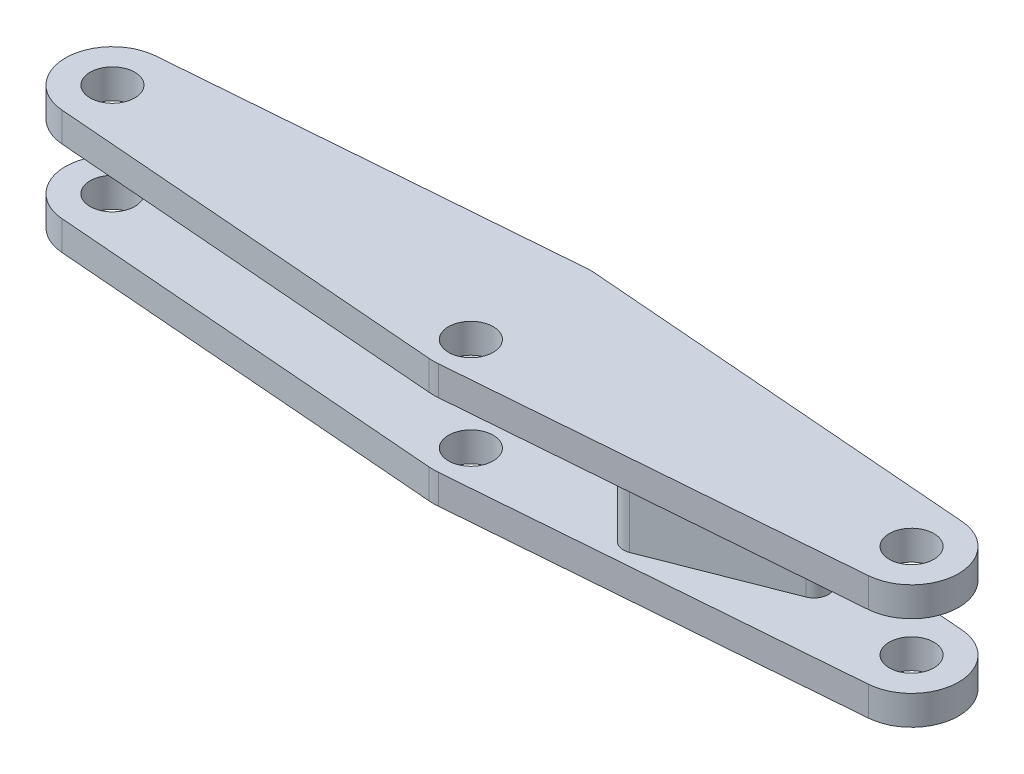
ISO-10303-21;
HEADER;
FILE_DESCRIPTION(('STEP AP214'),'2;1');
FILE_NAME('part.step','',(''),(''),'','','');
FILE_SCHEMA(('AUTOMOTIVE_DESIGN { 1 0 10303 214 1 1 1 1 }'));
ENDSEC;
DATA;
#1=APPLICATION_CONTEXT('core data for automotive mechanical design processes');
#2=APPLICATION_PROTOCOL_DEFINITION('international standard','automotive_design',2000,#1);
#3=PRODUCT_CONTEXT('',#1,'mechanical');
#4=PRODUCT('Part','Part','',(#3));
#5=PRODUCT_RELATED_PRODUCT_CATEGORY('part','',(#4));
#6=PRODUCT_DEFINITION_FORMATION('','',#4);
#7=PRODUCT_DEFINITION_CONTEXT('part definition',#1,'design');
#8=PRODUCT_DEFINITION('design','',#6,#7);
#9=PRODUCT_DEFINITION_SHAPE('','',#8);
#10=(LENGTH_UNIT() NAMED_UNIT(*) SI_UNIT(.MILLI.,.METRE.));
#11=(NAMED_UNIT(*) PLANE_ANGLE_UNIT() SI_UNIT($,.RADIAN.));
#12=(NAMED_UNIT(*) SI_UNIT($,.STERADIAN.) SOLID_ANGLE_UNIT());
#13=UNCERTAINTY_MEASURE_WITH_UNIT(LENGTH_MEASURE(1.E-05),#10,'distance_accuracy_value','');
#14=(GEOMETRIC_REPRESENTATION_CONTEXT(3) GLOBAL_UNCERTAINTY_ASSIGNED_CONTEXT((#13)) GLOBAL_UNIT_ASSIGNED_CONTEXT((#10,
#11,#12)) REPRESENTATION_CONTEXT('',''));
#15=CARTESIAN_POINT('',(0.,0.,0.));
#16=DIRECTION('',(0.,0.,1.));
#17=DIRECTION('',(1.,0.,0.));
#18=AXIS2_PLACEMENT_3D('',#15,#16,#17);
#19=CARTESIAN_POINT('',(-85.,13.125,0.));
#20=DIRECTION('',(0.,-1.,0.));
#21=DIRECTION('',(0.,0.,-1.));
#22=AXIS2_PLACEMENT_3D('',#19,#20,#21);
#23=CYLINDRICAL_SURFACE('',#22,9.99999999999999);
#24=CARTESIAN_POINT('',(-85.,6.875,0.));
#25=DIRECTION('',(0.,1.,0.));
#26=DIRECTION('',(0.,0.,1.));
#27=AXIS2_PLACEMENT_3D('',#24,#25,#26);
#28=CIRCLE('',#27,9.99999999999999);
#29=CARTESIAN_POINT('',(-85.7879901486688,6.875,-9.96890523205035));
#30=VERTEX_POINT('',#29);
#31=CARTESIAN_POINT('',(-85.7879901486688,6.875,9.96890523205035));
#32=VERTEX_POINT('',#31);
#33=EDGE_CURVE('E84',#30,#32,#28,.T.);
#34=ORIENTED_EDGE('',*,*,#33,.T.);
#35=DIRECTION('',(0.,-1.,0.));
#36=VECTOR('',#35,1.);
#37=CARTESIAN_POINT('',(-85.7879901486688,13.125,9.96890523205035));
#38=LINE('',#37,#36);
#39=CARTESIAN_POINT('',(-85.7879901486688,13.125,9.96890523205035));
#40=VERTEX_POINT('',#39);
#41=EDGE_CURVE('E301',#40,#32,#38,.T.);
#42=ORIENTED_EDGE('',*,*,#41,.F.);
#43=CARTESIAN_POINT('',(-85.,13.125,0.));
#44=DIRECTION('',(0.,1.,0.));
#45=DIRECTION('',(0.,0.,1.));
#46=AXIS2_PLACEMENT_3D('',#43,#44,#45);
#47=CIRCLE('',#46,9.99999999999999);
#48=CARTESIAN_POINT('',(-85.7879901486688,13.125,-9.96890523205035));
#49=VERTEX_POINT('',#48);
#50=EDGE_CURVE('E280',#49,#40,#47,.T.);
#51=ORIENTED_EDGE('',*,*,#50,.F.);
#52=DIRECTION('',(0.,-1.,0.));
#53=VECTOR('',#52,1.);
#54=CARTESIAN_POINT('',(-85.7879901486688,13.125,-9.96890523205035));
#55=LINE('',#54,#53);
#56=EDGE_CURVE('E37',#49,#30,#55,.T.);
#57=ORIENTED_EDGE('',*,*,#56,.T.);
#58=EDGE_LOOP('',(#34,#42,#51,#57));
#59=FACE_BOUND('',#58,.T.);
#60=ADVANCED_FACE('F33',(#59),#23,.T.);
#61=CARTESIAN_POINT('',(-0.984987685835979,13.125,16.6721418425663));
#62=DIRECTION('',(0.0787990148668748,0.,-0.996890523205036));
#63=DIRECTION('',(-0.996890523205036,0.,-0.0787990148668748));
#64=AXIS2_PLACEMENT_3D('',#61,#62,#63);
#65=PLANE('',#64);
#66=ORIENTED_EDGE('',*,*,#41,.T.);
#67=DIRECTION('',(0.996890523205036,0.,0.0787990148668748));
#68=VECTOR('',#67,1.);
#69=CARTESIAN_POINT('',(-0.984987685835979,6.875,16.6721418425663));
#70=LINE('',#69,#68);
#71=CARTESIAN_POINT('',(-0.984987685835975,6.875,16.6721418425663));
#72=VERTEX_POINT('',#71);
#73=EDGE_CURVE('E299',#32,#72,#70,.T.);
#74=ORIENTED_EDGE('',*,*,#73,.T.);
#75=DIRECTION('',(0.,-1.,0.));
#76=VECTOR('',#75,1.);
#77=CARTESIAN_POINT('',(-0.984987685835975,13.125,16.6721418425663));
#78=LINE('',#77,#76);
#79=CARTESIAN_POINT('',(-0.984987685835975,13.125,16.6721418425663));
#80=VERTEX_POINT('',#79);
#81=EDGE_CURVE('E294',#80,#72,#78,.T.);
#82=ORIENTED_EDGE('',*,*,#81,.F.);
#83=DIRECTION('',(0.996890523205036,0.,0.0787990148668748));
#84=VECTOR('',#83,1.);
#85=CARTESIAN_POINT('',(-0.984987685835979,13.125,16.6721418425663));
#86=LINE('',#85,#84);
#87=EDGE_CURVE('E115',#40,#80,#86,.T.);
#88=ORIENTED_EDGE('',*,*,#87,.F.);
#89=EDGE_LOOP('',(#66,#74,#82,#88));
#90=FACE_BOUND('',#89,.T.);
#91=ADVANCED_FACE('F364',(#90),#65,.F.);
#92=CARTESIAN_POINT('',(0.,13.125,4.21101030250334));
#93=DIRECTION('',(0.,-1.,0.));
#94=DIRECTION('',(0.,0.,-1.));
#95=AXIS2_PLACEMENT_3D('',#92,#93,#94);
#96=CYLINDRICAL_SURFACE('',#95,12.5);
#97=ORIENTED_EDGE('',*,*,#81,.T.);
#98=CARTESIAN_POINT('',(0.,6.875,4.21101030250334));
#99=DIRECTION('',(0.,1.,0.));
#100=DIRECTION('',(0.,0.,1.));
#101=AXIS2_PLACEMENT_3D('',#98,#99,#100);
#102=CIRCLE('',#101,12.5);
#103=CARTESIAN_POINT('',(0.984987685835979,6.875,16.6721418425663));
#104=VERTEX_POINT('',#103);
#105=EDGE_CURVE('E59',#72,#104,#102,.T.);
#106=ORIENTED_EDGE('',*,*,#105,.T.);
#107=DIRECTION('',(0.,-1.,0.));
#108=VECTOR('',#107,1.);
#109=CARTESIAN_POINT('',(0.984987685835979,13.125,16.6721418425663));
#110=LINE('',#109,#108);
#111=CARTESIAN_POINT('',(0.984987685835979,13.125,16.6721418425663));
#112=VERTEX_POINT('',#111);
#113=EDGE_CURVE('E293',#112,#104,#110,.T.);
#114=ORIENTED_EDGE('',*,*,#113,.F.);
#115=CARTESIAN_POINT('',(0.,13.125,4.21101030250334));
#116=DIRECTION('',(0.,1.,0.));
#117=DIRECTION('',(0.,0.,-1.));
#118=AXIS2_PLACEMENT_3D('',#115,#116,#117);
#119=CIRCLE('',#118,12.5);
#120=EDGE_CURVE('E277',#80,#112,#119,.T.);
#121=ORIENTED_EDGE('',*,*,#120,.F.);
#122=EDGE_LOOP('',(#97,#106,#114,#121));
#123=FACE_BOUND('',#122,.T.);
#124=ADVANCED_FACE('F361',(#123),#96,.T.);
#125=CARTESIAN_POINT('',(0.984987685835979,13.125,16.6721418425663));
#126=DIRECTION('',(-0.0787990148668748,0.,-0.996890523205036));
#127=DIRECTION('',(-0.996890523205036,0.,0.0787990148668748));
#128=AXIS2_PLACEMENT_3D('',#125,#126,#127);
#129=PLANE('',#128);
#130=ORIENTED_EDGE('',*,*,#113,.T.);
#131=DIRECTION('',(0.996890523205036,0.,-0.0787990148668748));
#132=VECTOR('',#131,1.);
#133=CARTESIAN_POINT('',(0.984987685835979,6.875,16.6721418425663));
#134=LINE('',#133,#132);
#135=CARTESIAN_POINT('',(85.7879901486688,6.875,9.96890523205035));
#136=VERTEX_POINT('',#135);
#137=EDGE_CURVE('E295',#104,#136,#134,.T.);
#138=ORIENTED_EDGE('',*,*,#137,.T.);
#139=DIRECTION('',(0.,-1.,0.));
#140=VECTOR('',#139,1.);
#141=CARTESIAN_POINT('',(85.7879901486688,13.125,9.96890523205035));
#142=LINE('',#141,#140);
#143=CARTESIAN_POINT('',(85.7879901486688,13.125,9.96890523205035));
#144=VERTEX_POINT('',#143);
#145=EDGE_CURVE('E303',#144,#136,#142,.T.);
#146=ORIENTED_EDGE('',*,*,#145,.F.);
#147=DIRECTION('',(0.996890523205036,0.,-0.0787990148668748));
#148=VECTOR('',#147,1.);
#149=CARTESIAN_POINT('',(0.984987685835979,13.125,16.6721418425663));
#150=LINE('',#149,#148);
#151=EDGE_CURVE('E275',#112,#144,#150,.T.);
#152=ORIENTED_EDGE('',*,*,#151,.F.);
#153=EDGE_LOOP('',(#130,#138,#146,#152));
#154=FACE_BOUND('',#153,.T.);
#155=ADVANCED_FACE('F350',(#154),#129,.F.);
#156=CARTESIAN_POINT('',(85.,13.125,0.));
#157=DIRECTION('',(0.,-1.,0.));
#158=DIRECTION('',(0.,0.,-1.));
#159=AXIS2_PLACEMENT_3D('',#156,#157,#158);
#160=CYLINDRICAL_SURFACE('',#159,9.99999999999999);
#161=CARTESIAN_POINT('',(85.,6.875,0.));
#162=DIRECTION('',(0.,1.,0.));
#163=DIRECTION('',(0.,0.,1.));
#164=AXIS2_PLACEMENT_3D('',#161,#162,#163);
#165=CIRCLE('',#164,9.99999999999999);
#166=CARTESIAN_POINT('',(85.7879901486688,6.875,-9.96890523205035));
#167=VERTEX_POINT('',#166);
#168=EDGE_CURVE('E298',#136,#167,#165,.T.);
#169=ORIENTED_EDGE('',*,*,#168,.T.);
#170=DIRECTION('',(0.,-1.,0.));
#171=VECTOR('',#170,1.);
#172=CARTESIAN_POINT('',(85.7879901486688,13.125,-9.96890523205035));
#173=LINE('',#172,#171);
#174=CARTESIAN_POINT('',(85.7879901486688,13.125,-9.96890523205035));
#175=VERTEX_POINT('',#174);
#176=EDGE_CURVE('E308',#175,#167,#173,.T.);
#177=ORIENTED_EDGE('',*,*,#176,.F.);
#178=CARTESIAN_POINT('',(85.,13.125,0.));
#179=DIRECTION('',(0.,1.,0.));
#180=DIRECTION('',(0.,0.,-1.));
#181=AXIS2_PLACEMENT_3D('',#178,#179,#180);
#182=CIRCLE('',#181,9.99999999999999);
#183=EDGE_CURVE('E273',#144,#175,#182,.T.);
#184=ORIENTED_EDGE('',*,*,#183,.F.);
#185=ORIENTED_EDGE('',*,*,#145,.T.);
#186=EDGE_LOOP('',(#169,#177,#184,#185));
#187=FACE_BOUND('',#186,.T.);
#188=ADVANCED_FACE('F353',(#187),#160,.T.);
#189=CARTESIAN_POINT('',(0.984987685835979,13.125,-16.6721418425663));
#190=DIRECTION('',(-0.0787990148668748,0.,0.996890523205036));
#191=DIRECTION('',(0.996890523205036,0.,0.0787990148668748));
#192=AXIS2_PLACEMENT_3D('',#189,#190,#191);
#193=PLANE('',#192);
#194=ORIENTED_EDGE('',*,*,#176,.T.);
#195=DIRECTION('',(-0.996890523205036,0.,-0.0787990148668748));
#196=VECTOR('',#195,1.);
#197=CARTESIAN_POINT('',(0.984987685835979,6.875,-16.6721418425663));
#198=LINE('',#197,#196);
#199=CARTESIAN_POINT('',(0.984987685835982,6.875,-16.6721418425663));
#200=VERTEX_POINT('',#199);
#201=EDGE_CURVE('E304',#167,#200,#198,.T.);
#202=ORIENTED_EDGE('',*,*,#201,.T.);
#203=DIRECTION('',(0.,-1.,0.));
#204=VECTOR('',#203,1.);
#205=CARTESIAN_POINT('',(0.984987685835982,13.125,-16.6721418425663));
#206=LINE('',#205,#204);
#207=CARTESIAN_POINT('',(0.984987685835982,13.125,-16.6721418425663));
#208=VERTEX_POINT('',#207);
#209=EDGE_CURVE('E311',#208,#200,#206,.T.);
#210=ORIENTED_EDGE('',*,*,#209,.F.);
#211=DIRECTION('',(-0.996890523205036,0.,-0.0787990148668748));
#212=VECTOR('',#211,1.);
#213=CARTESIAN_POINT('',(0.984987685835979,13.125,-16.6721418425663));
#214=LINE('',#213,#212);
#215=EDGE_CURVE('E271',#175,#208,#214,.T.);
#216=ORIENTED_EDGE('',*,*,#215,.F.);
#217=EDGE_LOOP('',(#194,#202,#210,#216));
#218=FACE_BOUND('',#217,.T.);
#219=ADVANCED_FACE('F343',(#218),#193,.F.);
#220=CARTESIAN_POINT('',(-0.984987685835979,13.125,-16.6721418425663));
#221=DIRECTION('',(0.0787990148668748,0.,0.996890523205036));
#222=DIRECTION('',(0.996890523205036,0.,-0.0787990148668748));
#223=AXIS2_PLACEMENT_3D('',#220,#221,#222);
#224=PLANE('',#223);
#225=DIRECTION('',(0.,-1.,0.));
#226=VECTOR('',#225,1.);
#227=CARTESIAN_POINT('',(-0.984987685835979,13.125,-16.6721418425663));
#228=LINE('',#227,#226);
#229=CARTESIAN_POINT('',(-0.984987685835979,13.125,-16.6721418425663));
#230=VERTEX_POINT('',#229);
#231=CARTESIAN_POINT('',(-0.984987685835979,6.875,-16.6721418425663));
#232=VERTEX_POINT('',#231);
#233=EDGE_CURVE('E307',#230,#232,#228,.T.);
#234=ORIENTED_EDGE('',*,*,#233,.T.);
#235=DIRECTION('',(-0.996890523205036,0.,0.0787990148668748));
#236=VECTOR('',#235,1.);
#237=CARTESIAN_POINT('',(-0.984987685835979,6.875,-16.6721418425663));
#238=LINE('',#237,#236);
#239=EDGE_CURVE('E287',#232,#30,#238,.T.);
#240=ORIENTED_EDGE('',*,*,#239,.T.);
#241=ORIENTED_EDGE('',*,*,#56,.F.);
#242=DIRECTION('',(-0.996890523205036,0.,0.0787990148668748));
#243=VECTOR('',#242,1.);
#244=CARTESIAN_POINT('',(-0.984987685835979,13.125,-16.6721418425663));
#245=LINE('',#244,#243);
#246=EDGE_CURVE('E267',#230,#49,#245,.T.);
#247=ORIENTED_EDGE('',*,*,#246,.F.);
#248=EDGE_LOOP('',(#234,#240,#241,#247));
#249=FACE_BOUND('',#248,.T.);
#250=ADVANCED_FACE('F330',(#249),#224,.F.);
#251=CARTESIAN_POINT('',(-85.,13.125,0.));
#252=DIRECTION('',(0.,-1.,0.));
#253=DIRECTION('',(0.,0.,-1.));
#254=AXIS2_PLACEMENT_3D('',#251,#252,#253);
#255=CYLINDRICAL_SURFACE('',#254,4.75);
#256=CARTESIAN_POINT('',(-85.,6.875,0.));
#257=DIRECTION('',(0.,1.,0.));
#258=DIRECTION('',(0.,0.,1.));
#259=AXIS2_PLACEMENT_3D('',#256,#257,#258);
#260=CIRCLE('',#259,4.75);
#261=CARTESIAN_POINT('',(-85.,6.875,4.75));
#262=VERTEX_POINT('',#261);
#263=EDGE_CURVE('E313',#262,#262,#260,.T.);
#264=ORIENTED_EDGE('',*,*,#263,.F.);
#265=EDGE_LOOP('',(#264));
#266=FACE_BOUND('',#265,.T.);
#267=CARTESIAN_POINT('',(-85.,13.125,0.));
#268=DIRECTION('',(0.,1.,0.));
#269=DIRECTION('',(0.,0.,1.));
#270=AXIS2_PLACEMENT_3D('',#267,#268,#269);
#271=CIRCLE('',#270,4.75);
#272=CARTESIAN_POINT('',(-85.,13.125,4.75));
#273=VERTEX_POINT('',#272);
#274=EDGE_CURVE('E283',#273,#273,#271,.T.);
#275=ORIENTED_EDGE('',*,*,#274,.T.);
#276=EDGE_LOOP('',(#275));
#277=FACE_BOUND('',#276,.T.);
#278=ADVANCED_FACE('F403',(#266,#277),#255,.F.);
#279=CARTESIAN_POINT('',(85.,13.125,0.));
#280=DIRECTION('',(0.,-1.,0.));
#281=DIRECTION('',(0.,0.,-1.));
#282=AXIS2_PLACEMENT_3D('',#279,#280,#281);
#283=CYLINDRICAL_SURFACE('',#282,4.75);
#284=CARTESIAN_POINT('',(85.,6.875,0.));
#285=DIRECTION('',(0.,1.,0.));
#286=DIRECTION('',(0.,0.,1.));
#287=AXIS2_PLACEMENT_3D('',#284,#285,#286);
#288=CIRCLE('',#287,4.75);
#289=CARTESIAN_POINT('',(85.,6.875,4.75));
#290=VERTEX_POINT('',#289);
#291=EDGE_CURVE('E42',#290,#290,#288,.T.);
#292=ORIENTED_EDGE('',*,*,#291,.F.);
#293=EDGE_LOOP('',(#292));
#294=FACE_BOUND('',#293,.T.);
#295=CARTESIAN_POINT('',(85.,13.125,0.));
#296=DIRECTION('',(0.,1.,0.));
#297=DIRECTION('',(0.,0.,-1.));
#298=AXIS2_PLACEMENT_3D('',#295,#296,#297);
#299=CIRCLE('',#298,4.75);
#300=CARTESIAN_POINT('',(85.,13.125,-4.75));
#301=VERTEX_POINT('',#300);
#302=EDGE_CURVE('E286',#301,#301,#299,.T.);
#303=ORIENTED_EDGE('',*,*,#302,.T.);
#304=EDGE_LOOP('',(#303));
#305=FACE_BOUND('',#304,.T.);
#306=ADVANCED_FACE('F412',(#294,#305),#283,.F.);
#307=CARTESIAN_POINT('',(0.,13.125,8.75));
#308=DIRECTION('',(0.,-1.,0.));
#309=DIRECTION('',(0.,0.,-1.));
#310=AXIS2_PLACEMENT_3D('',#307,#308,#309);
#311=CYLINDRICAL_SURFACE('',#310,4.75);
#312=CARTESIAN_POINT('',(0.,6.875,8.75));
#313=DIRECTION('',(0.,1.,0.));
#314=DIRECTION('',(0.,0.,1.));
#315=AXIS2_PLACEMENT_3D('',#312,#313,#314);
#316=CIRCLE('',#315,4.75);
#317=CARTESIAN_POINT('',(0.,6.875,13.5));
#318=VERTEX_POINT('',#317);
#319=EDGE_CURVE('E11',#318,#318,#316,.T.);
#320=ORIENTED_EDGE('',*,*,#319,.F.);
#321=EDGE_LOOP('',(#320));
#322=FACE_BOUND('',#321,.T.);
#323=CARTESIAN_POINT('',(0.,13.125,8.75));
#324=DIRECTION('',(0.,1.,0.));
#325=DIRECTION('',(0.,0.,1.));
#326=AXIS2_PLACEMENT_3D('',#323,#324,#325);
#327=CIRCLE('',#326,4.75);
#328=CARTESIAN_POINT('',(0.,13.125,13.5));
#329=VERTEX_POINT('',#328);
#330=EDGE_CURVE('E282',#329,#329,#327,.T.);
#331=ORIENTED_EDGE('',*,*,#330,.T.);
#332=EDGE_LOOP('',(#331));
#333=FACE_BOUND('',#332,.T.);
#334=ADVANCED_FACE('F35',(#322,#333),#311,.F.);
#335=CARTESIAN_POINT('',(-85.,13.125,0.));
#336=DIRECTION('',(0.,1.,0.));
#337=DIRECTION('',(0.,0.,1.));
#338=AXIS2_PLACEMENT_3D('',#335,#336,#337);
#339=PLANE('',#338);
#340=ORIENTED_EDGE('',*,*,#302,.F.);
#341=EDGE_LOOP('',(#340));
#342=FACE_BOUND('',#341,.T.);
#343=ORIENTED_EDGE('',*,*,#50,.T.);
#344=ORIENTED_EDGE('',*,*,#87,.T.);
#345=ORIENTED_EDGE('',*,*,#120,.T.);
#346=ORIENTED_EDGE('',*,*,#151,.T.);
#347=ORIENTED_EDGE('',*,*,#183,.T.);
#348=ORIENTED_EDGE('',*,*,#215,.T.);
#349=CARTESIAN_POINT('',(0.,13.125,-4.21101030250334));
#350=DIRECTION('',(0.,1.,0.));
#351=DIRECTION('',(0.,0.,-1.));
#352=AXIS2_PLACEMENT_3D('',#349,#350,#351);
#353=CIRCLE('',#352,12.5);
#354=EDGE_CURVE('E269',#208,#230,#353,.T.);
#355=ORIENTED_EDGE('',*,*,#354,.T.);
#356=ORIENTED_EDGE('',*,*,#246,.T.);
#357=EDGE_LOOP('',(#343,#344,#345,#346,#347,#348,#355,#356));
#358=FACE_BOUND('',#357,.T.);
#359=ORIENTED_EDGE('',*,*,#274,.F.);
#360=EDGE_LOOP('',(#359));
#361=FACE_BOUND('',#360,.T.);
#362=ORIENTED_EDGE('',*,*,#330,.F.);
#363=EDGE_LOOP('',(#362));
#364=FACE_BOUND('',#363,.T.);
#365=ADVANCED_FACE('F337',(#342,#358,#361,#364),#339,.T.);
#366=CARTESIAN_POINT('',(0.,13.125,-4.21101030250334));
#367=DIRECTION('',(0.,-1.,0.));
#368=DIRECTION('',(0.,0.,-1.));
#369=AXIS2_PLACEMENT_3D('',#366,#367,#368);
#370=CYLINDRICAL_SURFACE('',#369,12.5);
#371=CARTESIAN_POINT('',(0.,6.875,-4.21101030250334));
#372=DIRECTION('',(0.,1.,0.));
#373=DIRECTION('',(0.,0.,1.));
#374=AXIS2_PLACEMENT_3D('',#371,#372,#373);
#375=CIRCLE('',#374,12.5);
#376=EDGE_CURVE('E80',#200,#232,#375,.T.);
#377=ORIENTED_EDGE('',*,*,#376,.T.);
#378=ORIENTED_EDGE('',*,*,#233,.F.);
#379=ORIENTED_EDGE('',*,*,#354,.F.);
#380=ORIENTED_EDGE('',*,*,#209,.T.);
#381=EDGE_LOOP('',(#377,#378,#379,#380));
#382=FACE_BOUND('',#381,.T.);
#383=ADVANCED_FACE('F334',(#382),#370,.T.);
#384=CARTESIAN_POINT('',(95.,6.875,-16.7110103025033));
#385=DIRECTION('',(0.,1.,0.));
#386=DIRECTION('',(0.,0.,1.));
#387=AXIS2_PLACEMENT_3D('',#384,#385,#386);
#388=PLANE('',#387);
#389=DIRECTION('',(-0.93128348730271,0.,0.364295300926738));
#390=VECTOR('',#389,1.);
#391=CARTESIAN_POINT('',(33.9071140972198,6.875,5.52071326496727));
#392=LINE('',#391,#390);
#393=CARTESIAN_POINT('',(60.9143352289984,6.875,-5.04385046190813));
#394=VERTEX_POINT('',#393);
#395=CARTESIAN_POINT('',(33.9071140972198,6.875,5.52071326496727));
#396=VERTEX_POINT('',#395);
#397=EDGE_CURVE('E248',#394,#396,#392,.T.);
#398=ORIENTED_EDGE('',*,*,#397,.T.);
#399=CARTESIAN_POINT('',(35.,6.875,8.3145637268754));
#400=DIRECTION('',(0.,1.,0.));
#401=DIRECTION('',(0.,0.,1.));
#402=AXIS2_PLACEMENT_3D('',#399,#400,#401);
#403=CIRCLE('',#402,3.);
#404=CARTESIAN_POINT('',(36.0928859027802,6.875,11.1084141887835));
#405=VERTEX_POINT('',#404);
#406=EDGE_CURVE('E237',#396,#405,#403,.T.);
#407=ORIENTED_EDGE('',*,*,#406,.T.);
#408=DIRECTION('',(0.93128348730271,0.,-0.364295300926738));
#409=VECTOR('',#408,1.);
#410=CARTESIAN_POINT('',(36.0928859027802,6.875,11.1084141887835));
#411=LINE('',#410,#409);
#412=CARTESIAN_POINT('',(63.1001070345588,6.875,0.54385046190813));
#413=VERTEX_POINT('',#412);
#414=EDGE_CURVE('E244',#405,#413,#411,.T.);
#415=ORIENTED_EDGE('',*,*,#414,.T.);
#416=CARTESIAN_POINT('',(62.0072211317786,6.875,-2.25));
#417=DIRECTION('',(0.,1.,0.));
#418=DIRECTION('',(0.,0.,1.));
#419=AXIS2_PLACEMENT_3D('',#416,#417,#418);
#420=CIRCLE('',#419,3.);
#421=EDGE_CURVE('E50',#413,#394,#420,.T.);
#422=ORIENTED_EDGE('',*,*,#421,.T.);
#423=EDGE_LOOP('',(#398,#407,#415,#422));
#424=FACE_BOUND('',#423,.T.);
#425=ORIENTED_EDGE('',*,*,#263,.T.);
#426=EDGE_LOOP('',(#425));
#427=FACE_BOUND('',#426,.T.);
#428=ORIENTED_EDGE('',*,*,#291,.T.);
#429=EDGE_LOOP('',(#428));
#430=FACE_BOUND('',#429,.T.);
#431=ORIENTED_EDGE('',*,*,#319,.T.);
#432=EDGE_LOOP('',(#431));
#433=FACE_BOUND('',#432,.T.);
#434=ORIENTED_EDGE('',*,*,#73,.F.);
#435=ORIENTED_EDGE('',*,*,#33,.F.);
#436=ORIENTED_EDGE('',*,*,#239,.F.);
#437=ORIENTED_EDGE('',*,*,#376,.F.);
#438=ORIENTED_EDGE('',*,*,#201,.F.);
#439=ORIENTED_EDGE('',*,*,#168,.F.);
#440=ORIENTED_EDGE('',*,*,#137,.F.);
#441=ORIENTED_EDGE('',*,*,#105,.F.);
#442=EDGE_LOOP('',(#434,#435,#436,#437,#438,#439,#440,#441));
#443=FACE_BOUND('',#442,.T.);
#444=ADVANCED_FACE('F346',(#424,#427,#430,#433,#443),#388,.F.);
#445=CARTESIAN_POINT('',(35.,-6.875,8.3145637268754));
#446=DIRECTION('',(0.,1.,0.));
#447=DIRECTION('',(0.,0.,1.));
#448=AXIS2_PLACEMENT_3D('',#445,#446,#447);
#449=CYLINDRICAL_SURFACE('',#448,3.);
#450=DIRECTION('',(0.,1.,0.));
#451=VECTOR('',#450,1.);
#452=CARTESIAN_POINT('',(36.0928859027802,-6.875,11.1084141887835));
#453=LINE('',#452,#451);
#454=CARTESIAN_POINT('',(36.0928859027802,-6.875,11.1084141887835));
#455=VERTEX_POINT('',#454);
#456=EDGE_CURVE('E260',#455,#405,#453,.T.);
#457=ORIENTED_EDGE('',*,*,#456,.T.);
#458=ORIENTED_EDGE('',*,*,#406,.F.);
#459=DIRECTION('',(0.,1.,0.));
#460=VECTOR('',#459,1.);
#461=CARTESIAN_POINT('',(33.9071140972198,-6.875,5.52071326496727));
#462=LINE('',#461,#460);
#463=CARTESIAN_POINT('',(33.9071140972198,-6.875,5.52071326496727));
#464=VERTEX_POINT('',#463);
#465=EDGE_CURVE('E130',#464,#396,#462,.T.);
#466=ORIENTED_EDGE('',*,*,#465,.F.);
#467=CARTESIAN_POINT('',(35.,-6.875,8.3145637268754));
#468=DIRECTION('',(0.,1.,0.));
#469=DIRECTION('',(0.,0.,1.));
#470=AXIS2_PLACEMENT_3D('',#467,#468,#469);
#471=CIRCLE('',#470,3.);
#472=EDGE_CURVE('E251',#464,#455,#471,.T.);
#473=ORIENTED_EDGE('',*,*,#472,.T.);
#474=EDGE_LOOP('',(#457,#458,#466,#473));
#475=FACE_BOUND('',#474,.T.);
#476=ADVANCED_FACE('F456',(#475),#449,.T.);
#477=CARTESIAN_POINT('',(33.9071140972198,-6.875,5.52071326496727));
#478=DIRECTION('',(-0.364295300926738,0.,-0.93128348730271));
#479=DIRECTION('',(-0.93128348730271,0.,0.364295300926738));
#480=AXIS2_PLACEMENT_3D('',#477,#478,#479);
#481=PLANE('',#480);
#482=ORIENTED_EDGE('',*,*,#465,.T.);
#483=ORIENTED_EDGE('',*,*,#397,.F.);
#484=DIRECTION('',(0.,1.,0.));
#485=VECTOR('',#484,1.);
#486=CARTESIAN_POINT('',(60.9143352289984,-6.875,-5.04385046190813));
#487=LINE('',#486,#485);
#488=CARTESIAN_POINT('',(60.9143352289984,-6.875,-5.04385046190813));
#489=VERTEX_POINT('',#488);
#490=EDGE_CURVE('E262',#489,#394,#487,.T.);
#491=ORIENTED_EDGE('',*,*,#490,.F.);
#492=DIRECTION('',(-0.93128348730271,0.,0.364295300926738));
#493=VECTOR('',#492,1.);
#494=CARTESIAN_POINT('',(33.9071140972198,-6.875,5.52071326496727));
#495=LINE('',#494,#493);
#496=EDGE_CURVE('E258',#489,#464,#495,.T.);
#497=ORIENTED_EDGE('',*,*,#496,.T.);
#498=EDGE_LOOP('',(#482,#483,#491,#497));
#499=FACE_BOUND('',#498,.T.);
#500=ADVANCED_FACE('F467',(#499),#481,.T.);
#501=CARTESIAN_POINT('',(62.0072211317786,-6.875,-2.25));
#502=DIRECTION('',(0.,1.,0.));
#503=DIRECTION('',(0.,0.,1.));
#504=AXIS2_PLACEMENT_3D('',#501,#502,#503);
#505=CYLINDRICAL_SURFACE('',#504,3.);
#506=ORIENTED_EDGE('',*,*,#490,.T.);
#507=ORIENTED_EDGE('',*,*,#421,.F.);
#508=DIRECTION('',(0.,1.,0.));
#509=VECTOR('',#508,1.);
#510=CARTESIAN_POINT('',(63.1001070345588,-6.875,0.543850461908131));
#511=LINE('',#510,#509);
#512=CARTESIAN_POINT('',(63.1001070345588,-6.875,0.543850461908131));
#513=VERTEX_POINT('',#512);
#514=EDGE_CURVE('E264',#513,#413,#511,.T.);
#515=ORIENTED_EDGE('',*,*,#514,.F.);
#516=CARTESIAN_POINT('',(62.0072211317786,-6.875,-2.25));
#517=DIRECTION('',(0.,1.,0.));
#518=DIRECTION('',(0.,0.,1.));
#519=AXIS2_PLACEMENT_3D('',#516,#517,#518);
#520=CIRCLE('',#519,3.);
#521=EDGE_CURVE('E123',#513,#489,#520,.T.);
#522=ORIENTED_EDGE('',*,*,#521,.T.);
#523=EDGE_LOOP('',(#506,#507,#515,#522));
#524=FACE_BOUND('',#523,.T.);
#525=ADVANCED_FACE('F478',(#524),#505,.T.);
#526=CARTESIAN_POINT('',(36.0928859027802,-6.875,11.1084141887835));
#527=DIRECTION('',(0.364295300926738,0.,0.93128348730271));
#528=DIRECTION('',(0.93128348730271,0.,-0.364295300926738));
#529=AXIS2_PLACEMENT_3D('',#526,#527,#528);
#530=PLANE('',#529);
#531=ORIENTED_EDGE('',*,*,#514,.T.);
#532=ORIENTED_EDGE('',*,*,#414,.F.);
#533=ORIENTED_EDGE('',*,*,#456,.F.);
#534=DIRECTION('',(0.93128348730271,0.,-0.364295300926738));
#535=VECTOR('',#534,1.);
#536=CARTESIAN_POINT('',(36.0928859027802,-6.875,11.1084141887835));
#537=LINE('',#536,#535);
#538=EDGE_CURVE('E254',#455,#513,#537,.T.);
#539=ORIENTED_EDGE('',*,*,#538,.T.);
#540=EDGE_LOOP('',(#531,#532,#533,#539));
#541=FACE_BOUND('',#540,.T.);
#542=ADVANCED_FACE('F487',(#541),#530,.T.);
#543=CARTESIAN_POINT('',(85.,13.125,0.));
#544=DIRECTION('',(0.,-1.,0.));
#545=DIRECTION('',(0.,0.,-1.));
#546=AXIS2_PLACEMENT_3D('',#543,#544,#545);
#547=CYLINDRICAL_SURFACE('',#546,4.75);
#548=CARTESIAN_POINT('',(85.,-6.875,0.));
#549=DIRECTION('',(0.,-1.,0.));
#550=DIRECTION('',(0.,0.,-1.));
#551=AXIS2_PLACEMENT_3D('',#548,#549,#550);
#552=CIRCLE('',#551,4.75);
#553=CARTESIAN_POINT('',(85.,-6.875,-4.75));
#554=VERTEX_POINT('',#553);
#555=EDGE_CURVE('E241',#554,#554,#552,.T.);
#556=ORIENTED_EDGE('',*,*,#555,.F.);
#557=EDGE_LOOP('',(#556));
#558=FACE_BOUND('',#557,.T.);
#559=CARTESIAN_POINT('',(85.,-13.125,0.));
#560=DIRECTION('',(0.,1.,0.));
#561=DIRECTION('',(0.,0.,-1.));
#562=AXIS2_PLACEMENT_3D('',#559,#560,#561);
#563=CIRCLE('',#562,4.75);
#564=CARTESIAN_POINT('',(85.,-13.125,-4.75));
#565=VERTEX_POINT('',#564);
#566=EDGE_CURVE('E634',#565,#565,#563,.T.);
#567=ORIENTED_EDGE('',*,*,#566,.F.);
#568=EDGE_LOOP('',(#567));
#569=FACE_BOUND('',#568,.T.);
#570=ADVANCED_FACE('F496',(#558,#569),#547,.F.);
#571=CARTESIAN_POINT('',(-85.,13.125,0.));
#572=DIRECTION('',(0.,-1.,0.));
#573=DIRECTION('',(0.,0.,-1.));
#574=AXIS2_PLACEMENT_3D('',#571,#572,#573);
#575=CYLINDRICAL_SURFACE('',#574,4.75);
#576=CARTESIAN_POINT('',(-85.,-6.875,0.));
#577=DIRECTION('',(0.,-1.,0.));
#578=DIRECTION('',(0.,0.,-1.));
#579=AXIS2_PLACEMENT_3D('',#576,#577,#578);
#580=CIRCLE('',#579,4.75);
#581=CARTESIAN_POINT('',(-85.,-6.875,-4.75));
#582=VERTEX_POINT('',#581);
#583=EDGE_CURVE('E213',#582,#582,#580,.T.);
#584=ORIENTED_EDGE('',*,*,#583,.F.);
#585=EDGE_LOOP('',(#584));
#586=FACE_BOUND('',#585,.T.);
#587=CARTESIAN_POINT('',(-85.,-13.125,0.));
#588=DIRECTION('',(0.,1.,0.));
#589=DIRECTION('',(0.,0.,1.));
#590=AXIS2_PLACEMENT_3D('',#587,#588,#589);
#591=CIRCLE('',#590,4.75);
#592=CARTESIAN_POINT('',(-85.,-13.125,4.75));
#593=VERTEX_POINT('',#592);
#594=EDGE_CURVE('E637',#593,#593,#591,.T.);
#595=ORIENTED_EDGE('',*,*,#594,.F.);
#596=EDGE_LOOP('',(#595));
#597=FACE_BOUND('',#596,.T.);
#598=ADVANCED_FACE('F505',(#586,#597),#575,.F.);
#599=CARTESIAN_POINT('',(-0.984987685835979,13.125,-16.6721418425663));
#600=DIRECTION('',(0.0787990148668748,0.,0.996890523205036));
#601=DIRECTION('',(0.996890523205036,0.,-0.0787990148668748));
#602=AXIS2_PLACEMENT_3D('',#599,#600,#601);
#603=PLANE('',#602);
#604=DIRECTION('',(0.,-1.,0.));
#605=VECTOR('',#604,1.);
#606=CARTESIAN_POINT('',(-85.7879901486688,13.125,-9.96890523205035));
#607=LINE('',#606,#605);
#608=CARTESIAN_POINT('',(-85.7879901486688,-6.875,-9.96890523205035));
#609=VERTEX_POINT('',#608);
#610=CARTESIAN_POINT('',(-85.7879901486688,-13.125,-9.96890523205035));
#611=VERTEX_POINT('',#610);
#612=EDGE_CURVE('E198',#609,#611,#607,.T.);
#613=ORIENTED_EDGE('',*,*,#612,.F.);
#614=DIRECTION('',(0.996890523205036,0.,-0.0787990148668748));
#615=VECTOR('',#614,1.);
#616=CARTESIAN_POINT('',(-0.984987685835979,-6.875,-16.6721418425663));
#617=LINE('',#616,#615);
#618=CARTESIAN_POINT('',(-0.984987685835979,-6.875,-16.6721418425663));
#619=VERTEX_POINT('',#618);
#620=EDGE_CURVE('E207',#609,#619,#617,.T.);
#621=ORIENTED_EDGE('',*,*,#620,.T.);
#622=DIRECTION('',(0.,-1.,0.));
#623=VECTOR('',#622,1.);
#624=CARTESIAN_POINT('',(-0.984987685835979,13.125,-16.6721418425663));
#625=LINE('',#624,#623);
#626=CARTESIAN_POINT('',(-0.984987685835979,-13.125,-16.6721418425663));
#627=VERTEX_POINT('',#626);
#628=EDGE_CURVE('E219',#619,#627,#625,.T.);
#629=ORIENTED_EDGE('',*,*,#628,.T.);
#630=DIRECTION('',(-0.996890523205036,0.,0.0787990148668748));
#631=VECTOR('',#630,1.);
#632=CARTESIAN_POINT('',(-0.984987685835979,-13.125,-16.6721418425663));
#633=LINE('',#632,#631);
#634=EDGE_CURVE('E217',#627,#611,#633,.T.);
#635=ORIENTED_EDGE('',*,*,#634,.T.);
#636=EDGE_LOOP('',(#613,#621,#629,#635));
#637=FACE_BOUND('',#636,.T.);
#638=ADVANCED_FACE('F215',(#637),#603,.F.);
#639=CARTESIAN_POINT('',(0.,13.125,-4.21101030250334));
#640=DIRECTION('',(0.,-1.,0.));
#641=DIRECTION('',(0.,0.,-1.));
#642=AXIS2_PLACEMENT_3D('',#639,#640,#641);
#643=CYLINDRICAL_SURFACE('',#642,12.5);
#644=CARTESIAN_POINT('',(0.,-6.875,-4.21101030250334));
#645=DIRECTION('',(0.,-1.,0.));
#646=DIRECTION('',(0.,0.,-1.));
#647=AXIS2_PLACEMENT_3D('',#644,#645,#646);
#648=CIRCLE('',#647,12.5);
#649=CARTESIAN_POINT('',(0.984987685835982,-6.875,-16.6721418425663));
#650=VERTEX_POINT('',#649);
#651=EDGE_CURVE('E210',#619,#650,#648,.T.);
#652=ORIENTED_EDGE('',*,*,#651,.T.);
#653=DIRECTION('',(0.,-1.,0.));
#654=VECTOR('',#653,1.);
#655=CARTESIAN_POINT('',(0.984987685835982,13.125,-16.6721418425663));
#656=LINE('',#655,#654);
#657=CARTESIAN_POINT('',(0.984987685835982,-13.125,-16.6721418425663));
#658=VERTEX_POINT('',#657);
#659=EDGE_CURVE('E221',#650,#658,#656,.T.);
#660=ORIENTED_EDGE('',*,*,#659,.T.);
#661=CARTESIAN_POINT('',(0.,-13.125,-4.21101030250334));
#662=DIRECTION('',(0.,1.,0.));
#663=DIRECTION('',(0.,0.,-1.));
#664=AXIS2_PLACEMENT_3D('',#661,#662,#663);
#665=CIRCLE('',#664,12.5);
#666=EDGE_CURVE('E223',#658,#627,#665,.T.);
#667=ORIENTED_EDGE('',*,*,#666,.T.);
#668=ORIENTED_EDGE('',*,*,#628,.F.);
#669=EDGE_LOOP('',(#652,#660,#667,#668));
#670=FACE_BOUND('',#669,.T.);
#671=ADVANCED_FACE('F524',(#670),#643,.T.);
#672=CARTESIAN_POINT('',(0.984987685835979,13.125,-16.6721418425663));
#673=DIRECTION('',(-0.0787990148668748,0.,0.996890523205036));
#674=DIRECTION('',(0.996890523205036,0.,0.0787990148668748));
#675=AXIS2_PLACEMENT_3D('',#672,#673,#674);
#676=PLANE('',#675);
#677=ORIENTED_EDGE('',*,*,#659,.F.);
#678=DIRECTION('',(0.996890523205036,0.,0.0787990148668748));
#679=VECTOR('',#678,1.);
#680=CARTESIAN_POINT('',(0.984987685835979,-6.875,-16.6721418425663));
#681=LINE('',#680,#679);
#682=CARTESIAN_POINT('',(85.7879901486688,-6.875,-9.96890523205035));
#683=VERTEX_POINT('',#682);
#684=EDGE_CURVE('E677',#650,#683,#681,.T.);
#685=ORIENTED_EDGE('',*,*,#684,.T.);
#686=DIRECTION('',(0.,-1.,0.));
#687=VECTOR('',#686,1.);
#688=CARTESIAN_POINT('',(85.7879901486688,13.125,-9.96890523205035));
#689=LINE('',#688,#687);
#690=CARTESIAN_POINT('',(85.7879901486688,-13.125,-9.96890523205035));
#691=VERTEX_POINT('',#690);
#692=EDGE_CURVE('E228',#683,#691,#689,.T.);
#693=ORIENTED_EDGE('',*,*,#692,.T.);
#694=DIRECTION('',(-0.996890523205036,0.,-0.0787990148668748));
#695=VECTOR('',#694,1.);
#696=CARTESIAN_POINT('',(0.984987685835979,-13.125,-16.6721418425663));
#697=LINE('',#696,#695);
#698=EDGE_CURVE('E657',#691,#658,#697,.T.);
#699=ORIENTED_EDGE('',*,*,#698,.T.);
#700=EDGE_LOOP('',(#677,#685,#693,#699));
#701=FACE_BOUND('',#700,.T.);
#702=ADVANCED_FACE('F533',(#701),#676,.F.);
#703=CARTESIAN_POINT('',(85.,13.125,0.));
#704=DIRECTION('',(0.,-1.,0.));
#705=DIRECTION('',(0.,0.,-1.));
#706=AXIS2_PLACEMENT_3D('',#703,#704,#705);
#707=CYLINDRICAL_SURFACE('',#706,9.99999999999999);
#708=CARTESIAN_POINT('',(85.,-6.875,0.));
#709=DIRECTION('',(0.,-1.,0.));
#710=DIRECTION('',(0.,0.,-1.));
#711=AXIS2_PLACEMENT_3D('',#708,#709,#710);
#712=CIRCLE('',#711,9.99999999999999);
#713=CARTESIAN_POINT('',(85.7879901486688,-6.875,9.96890523205035));
#714=VERTEX_POINT('',#713);
#715=EDGE_CURVE('E675',#683,#714,#712,.T.);
#716=ORIENTED_EDGE('',*,*,#715,.T.);
#717=DIRECTION('',(0.,-1.,0.));
#718=VECTOR('',#717,1.);
#719=CARTESIAN_POINT('',(85.7879901486688,13.125,9.96890523205035));
#720=LINE('',#719,#718);
#721=CARTESIAN_POINT('',(85.7879901486688,-13.125,9.96890523205035));
#722=VERTEX_POINT('',#721);
#723=EDGE_CURVE('E230',#714,#722,#720,.T.);
#724=ORIENTED_EDGE('',*,*,#723,.T.);
#725=CARTESIAN_POINT('',(85.,-13.125,0.));
#726=DIRECTION('',(0.,1.,0.));
#727=DIRECTION('',(0.,0.,-1.));
#728=AXIS2_PLACEMENT_3D('',#725,#726,#727);
#729=CIRCLE('',#728,9.99999999999999);
#730=EDGE_CURVE('E654',#722,#691,#729,.T.);
#731=ORIENTED_EDGE('',*,*,#730,.T.);
#732=ORIENTED_EDGE('',*,*,#692,.F.);
#733=EDGE_LOOP('',(#716,#724,#731,#732));
#734=FACE_BOUND('',#733,.T.);
#735=ADVANCED_FACE('F543',(#734),#707,.T.);
#736=CARTESIAN_POINT('',(0.984987685835979,13.125,16.6721418425663));
#737=DIRECTION('',(-0.0787990148668748,0.,-0.996890523205036));
#738=DIRECTION('',(-0.996890523205036,0.,0.0787990148668748));
#739=AXIS2_PLACEMENT_3D('',#736,#737,#738);
#740=PLANE('',#739);
#741=ORIENTED_EDGE('',*,*,#723,.F.);
#742=DIRECTION('',(-0.996890523205036,0.,0.0787990148668748));
#743=VECTOR('',#742,1.);
#744=CARTESIAN_POINT('',(0.984987685835979,-6.875,16.6721418425663));
#745=LINE('',#744,#743);
#746=CARTESIAN_POINT('',(0.984987685835979,-6.875,16.6721418425663));
#747=VERTEX_POINT('',#746);
#748=EDGE_CURVE('E670',#714,#747,#745,.T.);
#749=ORIENTED_EDGE('',*,*,#748,.T.);
#750=DIRECTION('',(0.,-1.,0.));
#751=VECTOR('',#750,1.);
#752=CARTESIAN_POINT('',(0.984987685835979,13.125,16.6721418425663));
#753=LINE('',#752,#751);
#754=CARTESIAN_POINT('',(0.984987685835979,-13.125,16.6721418425663));
#755=VERTEX_POINT('',#754);
#756=EDGE_CURVE('E232',#747,#755,#753,.T.);
#757=ORIENTED_EDGE('',*,*,#756,.T.);
#758=DIRECTION('',(0.996890523205036,0.,-0.0787990148668748));
#759=VECTOR('',#758,1.);
#760=CARTESIAN_POINT('',(0.984987685835979,-13.125,16.6721418425663));
#761=LINE('',#760,#759);
#762=EDGE_CURVE('E651',#755,#722,#761,.T.);
#763=ORIENTED_EDGE('',*,*,#762,.T.);
#764=EDGE_LOOP('',(#741,#749,#757,#763));
#765=FACE_BOUND('',#764,.T.);
#766=ADVANCED_FACE('F553',(#765),#740,.F.);
#767=CARTESIAN_POINT('',(0.,13.125,4.21101030250334));
#768=DIRECTION('',(0.,-1.,0.));
#769=DIRECTION('',(0.,0.,-1.));
#770=AXIS2_PLACEMENT_3D('',#767,#768,#769);
#771=CYLINDRICAL_SURFACE('',#770,12.5);
#772=ORIENTED_EDGE('',*,*,#756,.F.);
#773=CARTESIAN_POINT('',(0.,-6.875,4.21101030250334));
#774=DIRECTION('',(0.,-1.,0.));
#775=DIRECTION('',(0.,0.,-1.));
#776=AXIS2_PLACEMENT_3D('',#773,#774,#775);
#777=CIRCLE('',#776,12.5);
#778=CARTESIAN_POINT('',(-0.984987685835975,-6.875,16.6721418425663));
#779=VERTEX_POINT('',#778);
#780=EDGE_CURVE('E669',#747,#779,#777,.T.);
#781=ORIENTED_EDGE('',*,*,#780,.T.);
#782=DIRECTION('',(0.,-1.,0.));
#783=VECTOR('',#782,1.);
#784=CARTESIAN_POINT('',(-0.984987685835975,13.125,16.6721418425663));
#785=LINE('',#784,#783);
#786=CARTESIAN_POINT('',(-0.984987685835975,-13.125,16.6721418425663));
#787=VERTEX_POINT('',#786);
#788=EDGE_CURVE('E234',#779,#787,#785,.T.);
#789=ORIENTED_EDGE('',*,*,#788,.T.);
#790=CARTESIAN_POINT('',(0.,-13.125,4.21101030250334));
#791=DIRECTION('',(0.,1.,0.));
#792=DIRECTION('',(0.,0.,-1.));
#793=AXIS2_PLACEMENT_3D('',#790,#791,#792);
#794=CIRCLE('',#793,12.5);
#795=EDGE_CURVE('E648',#787,#755,#794,.T.);
#796=ORIENTED_EDGE('',*,*,#795,.T.);
#797=EDGE_LOOP('',(#772,#781,#789,#796));
#798=FACE_BOUND('',#797,.T.);
#799=ADVANCED_FACE('F563',(#798),#771,.T.);
#800=CARTESIAN_POINT('',(-0.984987685835979,13.125,16.6721418425663));
#801=DIRECTION('',(0.0787990148668748,0.,-0.996890523205036));
#802=DIRECTION('',(-0.996890523205036,0.,-0.0787990148668748));
#803=AXIS2_PLACEMENT_3D('',#800,#801,#802);
#804=PLANE('',#803);
#805=ORIENTED_EDGE('',*,*,#788,.F.);
#806=DIRECTION('',(-0.996890523205036,0.,-0.0787990148668748));
#807=VECTOR('',#806,1.);
#808=CARTESIAN_POINT('',(-0.984987685835979,-6.875,16.6721418425663));
#809=LINE('',#808,#807);
#810=CARTESIAN_POINT('',(-85.7879901486688,-6.875,9.96890523205035));
#811=VERTEX_POINT('',#810);
#812=EDGE_CURVE('E204',#779,#811,#809,.T.);
#813=ORIENTED_EDGE('',*,*,#812,.T.);
#814=DIRECTION('',(0.,-1.,0.));
#815=VECTOR('',#814,1.);
#816=CARTESIAN_POINT('',(-85.7879901486688,13.125,9.96890523205035));
#817=LINE('',#816,#815);
#818=CARTESIAN_POINT('',(-85.7879901486688,-13.125,9.96890523205035));
#819=VERTEX_POINT('',#818);
#820=EDGE_CURVE('E200',#811,#819,#817,.T.);
#821=ORIENTED_EDGE('',*,*,#820,.T.);
#822=DIRECTION('',(0.996890523205036,0.,0.0787990148668748));
#823=VECTOR('',#822,1.);
#824=CARTESIAN_POINT('',(-0.984987685835979,-13.125,16.6721418425663));
#825=LINE('',#824,#823);
#826=EDGE_CURVE('E645',#819,#787,#825,.T.);
#827=ORIENTED_EDGE('',*,*,#826,.T.);
#828=EDGE_LOOP('',(#805,#813,#821,#827));
#829=FACE_BOUND('',#828,.T.);
#830=ADVANCED_FACE('F573',(#829),#804,.F.);
#831=CARTESIAN_POINT('',(-85.,13.125,0.));
#832=DIRECTION('',(0.,-1.,0.));
#833=DIRECTION('',(0.,0.,-1.));
#834=AXIS2_PLACEMENT_3D('',#831,#832,#833);
#835=CYLINDRICAL_SURFACE('',#834,9.99999999999999);
#836=CARTESIAN_POINT('',(-85.,-6.875,0.));
#837=DIRECTION('',(0.,-1.,0.));
#838=DIRECTION('',(0.,0.,-1.));
#839=AXIS2_PLACEMENT_3D('',#836,#837,#838);
#840=CIRCLE('',#839,9.99999999999999);
#841=EDGE_CURVE('E193',#811,#609,#840,.T.);
#842=ORIENTED_EDGE('',*,*,#841,.T.);
#843=ORIENTED_EDGE('',*,*,#612,.T.);
#844=CARTESIAN_POINT('',(-85.,-13.125,0.));
#845=DIRECTION('',(0.,1.,0.));
#846=DIRECTION('',(0.,0.,1.));
#847=AXIS2_PLACEMENT_3D('',#844,#845,#846);
#848=CIRCLE('',#847,9.99999999999999);
#849=EDGE_CURVE('E643',#611,#819,#848,.T.);
#850=ORIENTED_EDGE('',*,*,#849,.T.);
#851=ORIENTED_EDGE('',*,*,#820,.F.);
#852=EDGE_LOOP('',(#842,#843,#850,#851));
#853=FACE_BOUND('',#852,.T.);
#854=ADVANCED_FACE('F195',(#853),#835,.T.);
#855=CARTESIAN_POINT('',(-85.,-13.125,0.));
#856=DIRECTION('',(0.,1.,0.));
#857=DIRECTION('',(0.,0.,1.));
#858=AXIS2_PLACEMENT_3D('',#855,#856,#857);
#859=PLANE('',#858);
#860=ORIENTED_EDGE('',*,*,#849,.F.);
#861=ORIENTED_EDGE('',*,*,#634,.F.);
#862=ORIENTED_EDGE('',*,*,#666,.F.);
#863=ORIENTED_EDGE('',*,*,#698,.F.);
#864=ORIENTED_EDGE('',*,*,#730,.F.);
#865=ORIENTED_EDGE('',*,*,#762,.F.);
#866=ORIENTED_EDGE('',*,*,#795,.F.);
#867=ORIENTED_EDGE('',*,*,#826,.F.);
#868=EDGE_LOOP('',(#860,#861,#862,#863,#864,#865,#866,#867));
#869=FACE_BOUND('',#868,.T.);
#870=ORIENTED_EDGE('',*,*,#594,.T.);
#871=EDGE_LOOP('',(#870));
#872=FACE_BOUND('',#871,.T.);
#873=ORIENTED_EDGE('',*,*,#566,.T.);
#874=EDGE_LOOP('',(#873));
#875=FACE_BOUND('',#874,.T.);
#876=CARTESIAN_POINT('',(0.,-13.125,8.75));
#877=DIRECTION('',(0.,1.,0.));
#878=DIRECTION('',(0.,0.,1.));
#879=AXIS2_PLACEMENT_3D('',#876,#877,#878);
#880=CIRCLE('',#879,4.75);
#881=CARTESIAN_POINT('',(0.,-13.125,13.5));
#882=VERTEX_POINT('',#881);
#883=EDGE_CURVE('E203',#882,#882,#880,.T.);
#884=ORIENTED_EDGE('',*,*,#883,.T.);
#885=EDGE_LOOP('',(#884));
#886=FACE_BOUND('',#885,.T.);
#887=ADVANCED_FACE('F592',(#869,#872,#875,#886),#859,.F.);
#888=CARTESIAN_POINT('',(0.,13.125,8.75));
#889=DIRECTION('',(0.,-1.,0.));
#890=DIRECTION('',(0.,0.,-1.));
#891=AXIS2_PLACEMENT_3D('',#888,#889,#890);
#892=CYLINDRICAL_SURFACE('',#891,4.75);
#893=CARTESIAN_POINT('',(0.,-6.875,8.75));
#894=DIRECTION('',(0.,-1.,0.));
#895=DIRECTION('',(0.,0.,-1.));
#896=AXIS2_PLACEMENT_3D('',#893,#894,#895);
#897=CIRCLE('',#896,4.75);
#898=CARTESIAN_POINT('',(0.,-6.875,4.));
#899=VERTEX_POINT('',#898);
#900=EDGE_CURVE('E238',#899,#899,#897,.T.);
#901=ORIENTED_EDGE('',*,*,#900,.F.);
#902=EDGE_LOOP('',(#901));
#903=FACE_BOUND('',#902,.T.);
#904=ORIENTED_EDGE('',*,*,#883,.F.);
#905=EDGE_LOOP('',(#904));
#906=FACE_BOUND('',#905,.T.);
#907=ADVANCED_FACE('F601',(#903,#906),#892,.F.);
#908=CARTESIAN_POINT('',(95.,-6.875,-16.7110103025033));
#909=DIRECTION('',(0.,-1.,0.));
#910=DIRECTION('',(0.,0.,-1.));
#911=AXIS2_PLACEMENT_3D('',#908,#909,#910);
#912=PLANE('',#911);
#913=ORIENTED_EDGE('',*,*,#472,.F.);
#914=ORIENTED_EDGE('',*,*,#496,.F.);
#915=ORIENTED_EDGE('',*,*,#521,.F.);
#916=ORIENTED_EDGE('',*,*,#538,.F.);
#917=EDGE_LOOP('',(#913,#914,#915,#916));
#918=FACE_BOUND('',#917,.T.);
#919=ORIENTED_EDGE('',*,*,#583,.T.);
#920=EDGE_LOOP('',(#919));
#921=FACE_BOUND('',#920,.T.);
#922=ORIENTED_EDGE('',*,*,#555,.T.);
#923=EDGE_LOOP('',(#922));
#924=FACE_BOUND('',#923,.T.);
#925=ORIENTED_EDGE('',*,*,#900,.T.);
#926=EDGE_LOOP('',(#925));
#927=FACE_BOUND('',#926,.T.);
#928=ORIENTED_EDGE('',*,*,#841,.F.);
#929=ORIENTED_EDGE('',*,*,#812,.F.);
#930=ORIENTED_EDGE('',*,*,#780,.F.);
#931=ORIENTED_EDGE('',*,*,#748,.F.);
#932=ORIENTED_EDGE('',*,*,#715,.F.);
#933=ORIENTED_EDGE('',*,*,#684,.F.);
#934=ORIENTED_EDGE('',*,*,#651,.F.);
#935=ORIENTED_EDGE('',*,*,#620,.F.);
#936=EDGE_LOOP('',(#928,#929,#930,#931,#932,#933,#934,#935));
#937=FACE_BOUND('',#936,.T.);
#938=ADVANCED_FACE('F208',(#918,#921,#924,#927,#937),#912,.F.);
#939=CLOSED_SHELL('',(#60,#91,#124,#155,#188,#219,#250,#278,#306,#334,#365,#383,#444,#476,#500,
#525,#542,#570,#598,#638,#671,#702,#735,#766,#799,#830,#854,#887,#907,#938));
#940=MANIFOLD_SOLID_BREP('B2',#939);
#941=ADVANCED_BREP_SHAPE_REPRESENTATION('',(#18,#940),#14);
#942=SHAPE_DEFINITION_REPRESENTATION(#9,#941);
ENDSEC;
END-ISO-10303-21;
